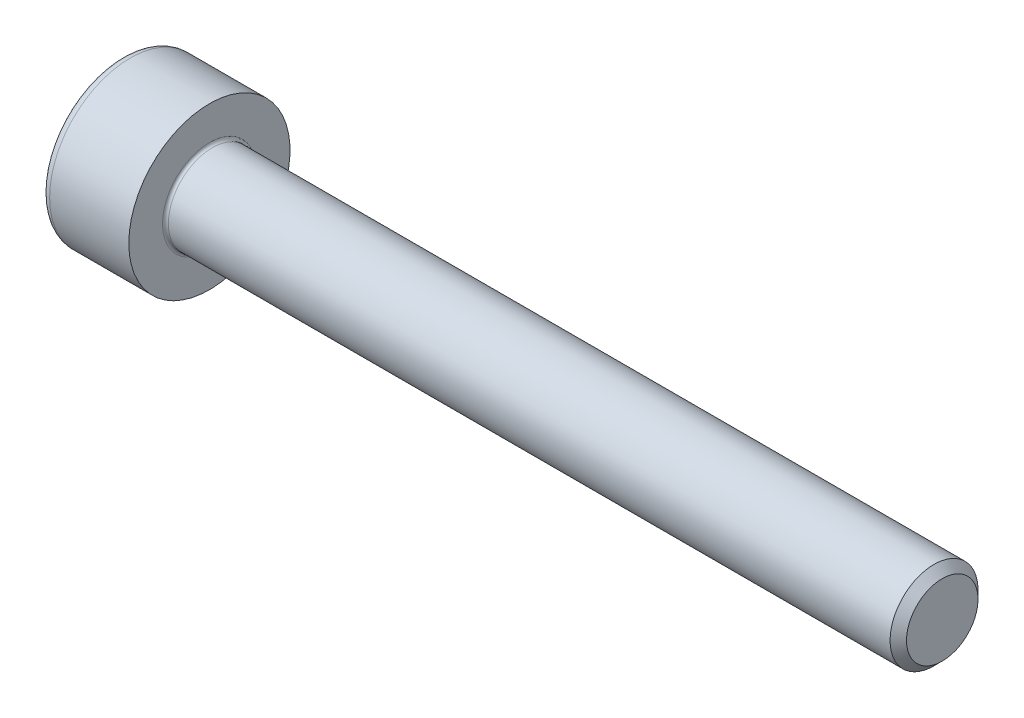
ISO-10303-21;
HEADER;
FILE_DESCRIPTION(('STEP AP214'),'2;1');
FILE_NAME('part.step','',(''),(''),'','','');
FILE_SCHEMA(('AUTOMOTIVE_DESIGN { 1 0 10303 214 1 1 1 1 }'));
ENDSEC;
DATA;
#1=APPLICATION_CONTEXT('core data for automotive mechanical design processes');
#2=APPLICATION_PROTOCOL_DEFINITION('international standard','automotive_design',2000,#1);
#3=PRODUCT_CONTEXT('',#1,'mechanical');
#4=PRODUCT('Part','Part','',(#3));
#5=PRODUCT_RELATED_PRODUCT_CATEGORY('part','',(#4));
#6=PRODUCT_DEFINITION_FORMATION('','',#4);
#7=PRODUCT_DEFINITION_CONTEXT('part definition',#1,'design');
#8=PRODUCT_DEFINITION('design','',#6,#7);
#9=PRODUCT_DEFINITION_SHAPE('','',#8);
#10=(LENGTH_UNIT() NAMED_UNIT(*) SI_UNIT(.MILLI.,.METRE.));
#11=(NAMED_UNIT(*) PLANE_ANGLE_UNIT() SI_UNIT($,.RADIAN.));
#12=(NAMED_UNIT(*) SI_UNIT($,.STERADIAN.) SOLID_ANGLE_UNIT());
#13=UNCERTAINTY_MEASURE_WITH_UNIT(LENGTH_MEASURE(1.E-05),#10,'distance_accuracy_value','');
#14=(GEOMETRIC_REPRESENTATION_CONTEXT(3) GLOBAL_UNCERTAINTY_ASSIGNED_CONTEXT((#13)) GLOBAL_UNIT_ASSIGNED_CONTEXT((#10,
#11,#12)) REPRESENTATION_CONTEXT('',''));
#15=CARTESIAN_POINT('',(0.,0.,0.));
#16=DIRECTION('',(0.,0.,1.));
#17=DIRECTION('',(1.,0.,0.));
#18=AXIS2_PLACEMENT_3D('',#15,#16,#17);
#19=CARTESIAN_POINT('',(0.,0.,0.));
#20=DIRECTION('',(-1.,0.,0.));
#21=DIRECTION('',(0.,0.,1.));
#22=AXIS2_PLACEMENT_3D('',#19,#20,#21);
#23=PLANE('',#22);
#24=DIRECTION('',(0.,-0.499999999999998,0.86602540378444));
#25=VECTOR('',#24,1.);
#26=CARTESIAN_POINT('',(0.,1.45492267835785,0.));
#27=LINE('',#26,#25);
#28=CARTESIAN_POINT('',(0.,1.45492267835785,0.));
#29=VERTEX_POINT('',#28);
#30=CARTESIAN_POINT('',(0.,0.727461339178925,1.26));
#31=VERTEX_POINT('',#30);
#32=EDGE_CURVE('E273',#29,#31,#27,.T.);
#33=ORIENTED_EDGE('',*,*,#32,.T.);
#34=DIRECTION('',(0.,1.,0.));
#35=VECTOR('',#34,1.);
#36=CARTESIAN_POINT('',(0.,-0.727461339178932,1.26));
#37=LINE('',#36,#35);
#38=CARTESIAN_POINT('',(0.,-0.727461339178932,1.26));
#39=VERTEX_POINT('',#38);
#40=EDGE_CURVE('E133',#39,#31,#37,.T.);
#41=ORIENTED_EDGE('',*,*,#40,.F.);
#42=DIRECTION('',(0.,-0.500000000000001,-0.866025403784438));
#43=VECTOR('',#42,1.);
#44=CARTESIAN_POINT('',(0.,-0.727461339178932,1.26));
#45=LINE('',#44,#43);
#46=CARTESIAN_POINT('',(0.,-1.45492267835786,0.));
#47=VERTEX_POINT('',#46);
#48=EDGE_CURVE('E276',#39,#47,#45,.T.);
#49=ORIENTED_EDGE('',*,*,#48,.T.);
#50=DIRECTION('',(0.,0.499999999999998,-0.86602540378444));
#51=VECTOR('',#50,1.);
#52=CARTESIAN_POINT('',(0.,-1.45492267835786,0.));
#53=LINE('',#52,#51);
#54=CARTESIAN_POINT('',(0.,-0.727461339178936,-1.26));
#55=VERTEX_POINT('',#54);
#56=EDGE_CURVE('E279',#47,#55,#53,.T.);
#57=ORIENTED_EDGE('',*,*,#56,.T.);
#58=DIRECTION('',(0.,-1.,0.));
#59=VECTOR('',#58,1.);
#60=CARTESIAN_POINT('',(0.,0.72746133917892,-1.26));
#61=LINE('',#60,#59);
#62=CARTESIAN_POINT('',(0.,0.72746133917892,-1.26));
#63=VERTEX_POINT('',#62);
#64=EDGE_CURVE('E282',#63,#55,#61,.T.);
#65=ORIENTED_EDGE('',*,*,#64,.F.);
#66=DIRECTION('',(0.,-0.500000000000001,-0.866025403784438));
#67=VECTOR('',#66,1.);
#68=CARTESIAN_POINT('',(0.,1.45492267835785,0.));
#69=LINE('',#68,#67);
#70=EDGE_CURVE('E128',#29,#63,#69,.T.);
#71=ORIENTED_EDGE('',*,*,#70,.F.);
#72=EDGE_LOOP('',(#33,#41,#49,#57,#65,#71));
#73=FACE_BOUND('',#72,.T.);
#74=CARTESIAN_POINT('',(0.,0.,0.));
#75=DIRECTION('',(-1.,0.,0.));
#76=DIRECTION('',(0.,0.,1.));
#77=AXIS2_PLACEMENT_3D('',#74,#75,#76);
#78=CIRCLE('',#77,2.45);
#79=CARTESIAN_POINT('',(0.,0.,2.45));
#80=VERTEX_POINT('',#79);
#81=EDGE_CURVE('E49',#80,#80,#78,.T.);
#82=ORIENTED_EDGE('',*,*,#81,.T.);
#83=EDGE_LOOP('',(#82));
#84=FACE_BOUND('',#83,.T.);
#85=ADVANCED_FACE('F41',(#73,#84),#23,.T.);
#86=CARTESIAN_POINT('',(-31.75,0.,0.));
#87=DIRECTION('',(-1.,0.,0.));
#88=DIRECTION('',(0.,0.,1.));
#89=AXIS2_PLACEMENT_3D('',#86,#87,#88);
#90=CYLINDRICAL_SURFACE('',#89,2.75);
#91=CARTESIAN_POINT('',(0.300000000000002,0.,0.));
#92=DIRECTION('',(-1.,0.,0.));
#93=DIRECTION('',(0.,0.,1.));
#94=AXIS2_PLACEMENT_3D('',#91,#92,#93);
#95=CIRCLE('',#94,2.75);
#96=CARTESIAN_POINT('',(0.300000000000002,0.,2.75));
#97=VERTEX_POINT('',#96);
#98=EDGE_CURVE('E11',#97,#97,#95,.F.);
#99=ORIENTED_EDGE('',*,*,#98,.T.);
#100=EDGE_LOOP('',(#99));
#101=FACE_BOUND('',#100,.T.);
#102=CARTESIAN_POINT('',(3.,0.,0.));
#103=DIRECTION('',(-1.,0.,0.));
#104=DIRECTION('',(0.,0.,1.));
#105=AXIS2_PLACEMENT_3D('',#102,#103,#104);
#106=CIRCLE('',#105,2.75);
#107=CARTESIAN_POINT('',(3.,0.,2.75));
#108=VERTEX_POINT('',#107);
#109=EDGE_CURVE('E151',#108,#108,#106,.T.);
#110=ORIENTED_EDGE('',*,*,#109,.T.);
#111=EDGE_LOOP('',(#110));
#112=FACE_BOUND('',#111,.T.);
#113=ADVANCED_FACE('F176',(#101,#112),#90,.T.);
#114=CARTESIAN_POINT('',(3.,2.75,0.));
#115=DIRECTION('',(1.,0.,0.));
#116=DIRECTION('',(0.,0.,-1.));
#117=AXIS2_PLACEMENT_3D('',#114,#115,#116);
#118=PLANE('',#117);
#119=CARTESIAN_POINT('',(3.,0.,0.));
#120=DIRECTION('',(1.,0.,0.));
#121=DIRECTION('',(0.,0.,-1.));
#122=AXIS2_PLACEMENT_3D('',#119,#120,#121);
#123=CIRCLE('',#122,1.59999999999999);
#124=CARTESIAN_POINT('',(3.,0.,-1.59999999999999));
#125=VERTEX_POINT('',#124);
#126=EDGE_CURVE('E155',#125,#125,#123,.F.);
#127=ORIENTED_EDGE('',*,*,#126,.T.);
#128=EDGE_LOOP('',(#127));
#129=FACE_BOUND('',#128,.T.);
#130=ORIENTED_EDGE('',*,*,#109,.F.);
#131=EDGE_LOOP('',(#130));
#132=FACE_BOUND('',#131,.T.);
#133=ADVANCED_FACE('F182',(#129,#132),#118,.T.);
#134=CARTESIAN_POINT('',(-31.75,0.,0.));
#135=DIRECTION('',(-1.,0.,0.));
#136=DIRECTION('',(0.,0.,1.));
#137=AXIS2_PLACEMENT_3D('',#134,#135,#136);
#138=CYLINDRICAL_SURFACE('',#137,1.49999999999999);
#139=CARTESIAN_POINT('',(3.1,0.,0.));
#140=DIRECTION('',(1.,0.,0.));
#141=DIRECTION('',(0.,0.,-1.));
#142=AXIS2_PLACEMENT_3D('',#139,#140,#141);
#143=CIRCLE('',#142,1.49999999999999);
#144=CARTESIAN_POINT('',(3.1,0.,-1.49999999999999));
#145=VERTEX_POINT('',#144);
#146=EDGE_CURVE('E158',#145,#145,#143,.T.);
#147=ORIENTED_EDGE('',*,*,#146,.T.);
#148=EDGE_LOOP('',(#147));
#149=FACE_BOUND('',#148,.T.);
#150=CARTESIAN_POINT('',(27.7195,0.,0.));
#151=DIRECTION('',(-1.,0.,0.));
#152=DIRECTION('',(0.,0.,1.));
#153=AXIS2_PLACEMENT_3D('',#150,#151,#152);
#154=CIRCLE('',#153,1.49999999999998);
#155=CARTESIAN_POINT('',(27.7195,0.,1.49999999999998));
#156=VERTEX_POINT('',#155);
#157=EDGE_CURVE('E148',#156,#156,#154,.T.);
#158=ORIENTED_EDGE('',*,*,#157,.T.);
#159=EDGE_LOOP('',(#158));
#160=FACE_BOUND('',#159,.T.);
#161=ADVANCED_FACE('F188',(#149,#160),#138,.T.);
#162=CARTESIAN_POINT('',(28.,0.,0.));
#163=DIRECTION('',(-1.,0.,0.));
#164=DIRECTION('',(0.,0.,1.));
#165=AXIS2_PLACEMENT_3D('',#162,#163,#164);
#166=CONICAL_SURFACE('',#165,1.2195,0.785398163397376);
#167=ORIENTED_EDGE('',*,*,#157,.F.);
#168=EDGE_LOOP('',(#167));
#169=FACE_BOUND('',#168,.T.);
#170=CARTESIAN_POINT('',(28.,0.,0.));
#171=DIRECTION('',(-1.,0.,0.));
#172=DIRECTION('',(0.,0.,1.));
#173=AXIS2_PLACEMENT_3D('',#170,#171,#172);
#174=CIRCLE('',#173,1.2195);
#175=CARTESIAN_POINT('',(28.,0.,1.2195));
#176=VERTEX_POINT('',#175);
#177=EDGE_CURVE('E144',#176,#176,#174,.T.);
#178=ORIENTED_EDGE('',*,*,#177,.T.);
#179=EDGE_LOOP('',(#178));
#180=FACE_BOUND('',#179,.T.);
#181=ADVANCED_FACE('F192',(#169,#180),#166,.T.);
#182=CARTESIAN_POINT('',(28.,1.2195,0.));
#183=DIRECTION('',(1.,0.,0.));
#184=DIRECTION('',(0.,0.,-1.));
#185=AXIS2_PLACEMENT_3D('',#182,#183,#184);
#186=PLANE('',#185);
#187=ORIENTED_EDGE('',*,*,#177,.F.);
#188=EDGE_LOOP('',(#187));
#189=FACE_BOUND('',#188,.T.);
#190=ADVANCED_FACE('F172',(#189),#186,.T.);
#191=CARTESIAN_POINT('',(3.1,0.,0.));
#192=DIRECTION('',(1.,0.,0.));
#193=DIRECTION('',(0.,0.,-1.));
#194=AXIS2_PLACEMENT_3D('',#191,#192,#193);
#195=TOROIDAL_SURFACE('',#194,1.59999999999999,0.1);
#196=ORIENTED_EDGE('',*,*,#146,.F.);
#197=EDGE_LOOP('',(#196));
#198=FACE_BOUND('',#197,.T.);
#199=ORIENTED_EDGE('',*,*,#126,.F.);
#200=EDGE_LOOP('',(#199));
#201=FACE_BOUND('',#200,.T.);
#202=ADVANCED_FACE('F165',(#198,#201),#195,.F.);
#203=CARTESIAN_POINT('',(0.300000000000002,0.,0.));
#204=DIRECTION('',(-1.,0.,0.));
#205=DIRECTION('',(0.,0.,1.));
#206=AXIS2_PLACEMENT_3D('',#203,#204,#205);
#207=TOROIDAL_SURFACE('',#206,2.45,0.3);
#208=ORIENTED_EDGE('',*,*,#98,.F.);
#209=EDGE_LOOP('',(#208));
#210=FACE_BOUND('',#209,.T.);
#211=ORIENTED_EDGE('',*,*,#81,.F.);
#212=EDGE_LOOP('',(#211));
#213=FACE_BOUND('',#212,.T.);
#214=ADVANCED_FACE('F43',(#210,#213),#207,.T.);
#215=CARTESIAN_POINT('',(1.3,1.45492267835785,0.));
#216=DIRECTION('',(0.,-0.86602540378444,-0.499999999999998));
#217=DIRECTION('',(0.,0.499999999999998,-0.86602540378444));
#218=AXIS2_PLACEMENT_3D('',#215,#216,#217);
#219=PLANE('',#218);
#220=ORIENTED_EDGE('',*,*,#32,.F.);
#221=DIRECTION('',(-1.,0.,0.));
#222=VECTOR('',#221,1.);
#223=CARTESIAN_POINT('',(1.3,1.45492267835785,0.));
#224=LINE('',#223,#222);
#225=CARTESIAN_POINT('',(1.3,1.45492267835785,0.));
#226=VERTEX_POINT('',#225);
#227=EDGE_CURVE('E272',#226,#29,#224,.T.);
#228=ORIENTED_EDGE('',*,*,#227,.F.);
#229=DIRECTION('',(0.,-0.499999999999998,0.86602540378444));
#230=VECTOR('',#229,1.);
#231=CARTESIAN_POINT('',(1.3,1.45492267835785,0.));
#232=LINE('',#231,#230);
#233=CARTESIAN_POINT('',(1.3,1.09119200876839,0.629999999999998));
#234=VERTEX_POINT('',#233);
#235=EDGE_CURVE('E56',#226,#234,#232,.T.);
#236=ORIENTED_EDGE('',*,*,#235,.T.);
#237=CARTESIAN_POINT('',(1.3,0.727461339178925,1.26));
#238=VERTEX_POINT('',#237);
#239=EDGE_CURVE('E114',#234,#238,#232,.T.);
#240=ORIENTED_EDGE('',*,*,#239,.T.);
#241=DIRECTION('',(-1.,0.,0.));
#242=VECTOR('',#241,1.);
#243=CARTESIAN_POINT('',(1.3,0.727461339178925,1.26));
#244=LINE('',#243,#242);
#245=EDGE_CURVE('E126',#238,#31,#244,.T.);
#246=ORIENTED_EDGE('',*,*,#245,.T.);
#247=EDGE_LOOP('',(#220,#228,#236,#240,#246));
#248=FACE_BOUND('',#247,.T.);
#249=ADVANCED_FACE('F125',(#248),#219,.T.);
#250=CARTESIAN_POINT('',(1.3,-0.727461339178932,1.26));
#251=DIRECTION('',(0.,0.,1.));
#252=DIRECTION('',(0.,-1.,0.));
#253=AXIS2_PLACEMENT_3D('',#250,#251,#252);
#254=PLANE('',#253);
#255=ORIENTED_EDGE('',*,*,#40,.T.);
#256=ORIENTED_EDGE('',*,*,#245,.F.);
#257=DIRECTION('',(0.,1.,0.));
#258=VECTOR('',#257,1.);
#259=CARTESIAN_POINT('',(1.3,-0.727461339178932,1.26));
#260=LINE('',#259,#258);
#261=CARTESIAN_POINT('',(1.3,0.,1.26));
#262=VERTEX_POINT('',#261);
#263=EDGE_CURVE('E112',#262,#238,#260,.T.);
#264=ORIENTED_EDGE('',*,*,#263,.F.);
#265=CARTESIAN_POINT('',(1.3,-0.727461339178932,1.26));
#266=VERTEX_POINT('',#265);
#267=EDGE_CURVE('E122',#266,#262,#260,.T.);
#268=ORIENTED_EDGE('',*,*,#267,.F.);
#269=DIRECTION('',(-1.,0.,0.));
#270=VECTOR('',#269,1.);
#271=CARTESIAN_POINT('',(1.3,-0.727461339178932,1.26));
#272=LINE('',#271,#270);
#273=EDGE_CURVE('E135',#266,#39,#272,.T.);
#274=ORIENTED_EDGE('',*,*,#273,.T.);
#275=EDGE_LOOP('',(#255,#256,#264,#268,#274));
#276=FACE_BOUND('',#275,.T.);
#277=ADVANCED_FACE('F130',(#276),#254,.F.);
#278=CARTESIAN_POINT('',(1.3,-0.727461339178932,1.26));
#279=DIRECTION('',(0.,0.866025403784438,-0.500000000000001));
#280=DIRECTION('',(0.,0.500000000000001,0.866025403784438));
#281=AXIS2_PLACEMENT_3D('',#278,#279,#280);
#282=PLANE('',#281);
#283=ORIENTED_EDGE('',*,*,#48,.F.);
#284=ORIENTED_EDGE('',*,*,#273,.F.);
#285=DIRECTION('',(0.,-0.500000000000001,-0.866025403784438));
#286=VECTOR('',#285,1.);
#287=CARTESIAN_POINT('',(1.3,-0.727461339178932,1.26));
#288=LINE('',#287,#286);
#289=CARTESIAN_POINT('',(1.3,-1.0911920087684,0.630000000000003));
#290=VERTEX_POINT('',#289);
#291=EDGE_CURVE('E253',#266,#290,#288,.T.);
#292=ORIENTED_EDGE('',*,*,#291,.T.);
#293=CARTESIAN_POINT('',(1.3,-1.45492267835786,0.));
#294=VERTEX_POINT('',#293);
#295=EDGE_CURVE('E255',#290,#294,#288,.T.);
#296=ORIENTED_EDGE('',*,*,#295,.T.);
#297=DIRECTION('',(-1.,0.,0.));
#298=VECTOR('',#297,1.);
#299=CARTESIAN_POINT('',(1.3,-1.45492267835786,0.));
#300=LINE('',#299,#298);
#301=EDGE_CURVE('E140',#294,#47,#300,.T.);
#302=ORIENTED_EDGE('',*,*,#301,.T.);
#303=EDGE_LOOP('',(#283,#284,#292,#296,#302));
#304=FACE_BOUND('',#303,.T.);
#305=ADVANCED_FACE('F205',(#304),#282,.T.);
#306=CARTESIAN_POINT('',(1.3,-1.45492267835786,0.));
#307=DIRECTION('',(0.,0.86602540378444,0.499999999999998));
#308=DIRECTION('',(0.,-0.499999999999998,0.86602540378444));
#309=AXIS2_PLACEMENT_3D('',#306,#307,#308);
#310=PLANE('',#309);
#311=ORIENTED_EDGE('',*,*,#56,.F.);
#312=ORIENTED_EDGE('',*,*,#301,.F.);
#313=DIRECTION('',(0.,0.499999999999998,-0.86602540378444));
#314=VECTOR('',#313,1.);
#315=CARTESIAN_POINT('',(1.3,-1.45492267835786,0.));
#316=LINE('',#315,#314);
#317=CARTESIAN_POINT('',(1.3,-1.0911920087684,-0.63));
#318=VERTEX_POINT('',#317);
#319=EDGE_CURVE('E258',#294,#318,#316,.T.);
#320=ORIENTED_EDGE('',*,*,#319,.T.);
#321=CARTESIAN_POINT('',(1.3,-0.727461339178936,-1.26));
#322=VERTEX_POINT('',#321);
#323=EDGE_CURVE('E262',#318,#322,#316,.T.);
#324=ORIENTED_EDGE('',*,*,#323,.T.);
#325=DIRECTION('',(-1.,0.,0.));
#326=VECTOR('',#325,1.);
#327=CARTESIAN_POINT('',(1.3,-0.727461339178936,-1.26));
#328=LINE('',#327,#326);
#329=EDGE_CURVE('E291',#322,#55,#328,.T.);
#330=ORIENTED_EDGE('',*,*,#329,.T.);
#331=EDGE_LOOP('',(#311,#312,#320,#324,#330));
#332=FACE_BOUND('',#331,.T.);
#333=ADVANCED_FACE('F208',(#332),#310,.T.);
#334=CARTESIAN_POINT('',(1.3,0.72746133917892,-1.26));
#335=DIRECTION('',(0.,0.,-1.));
#336=DIRECTION('',(0.,1.,0.));
#337=AXIS2_PLACEMENT_3D('',#334,#335,#336);
#338=PLANE('',#337);
#339=ORIENTED_EDGE('',*,*,#64,.T.);
#340=ORIENTED_EDGE('',*,*,#329,.F.);
#341=DIRECTION('',(0.,-1.,0.));
#342=VECTOR('',#341,1.);
#343=CARTESIAN_POINT('',(1.3,0.72746133917892,-1.26));
#344=LINE('',#343,#342);
#345=CARTESIAN_POINT('',(1.3,0.,-1.26));
#346=VERTEX_POINT('',#345);
#347=EDGE_CURVE('E266',#346,#322,#344,.T.);
#348=ORIENTED_EDGE('',*,*,#347,.F.);
#349=CARTESIAN_POINT('',(1.3,0.72746133917892,-1.26));
#350=VERTEX_POINT('',#349);
#351=EDGE_CURVE('E267',#350,#346,#344,.T.);
#352=ORIENTED_EDGE('',*,*,#351,.F.);
#353=DIRECTION('',(-1.,0.,0.));
#354=VECTOR('',#353,1.);
#355=CARTESIAN_POINT('',(1.3,0.72746133917892,-1.26));
#356=LINE('',#355,#354);
#357=EDGE_CURVE('E288',#350,#63,#356,.T.);
#358=ORIENTED_EDGE('',*,*,#357,.T.);
#359=EDGE_LOOP('',(#339,#340,#348,#352,#358));
#360=FACE_BOUND('',#359,.T.);
#361=ADVANCED_FACE('F212',(#360),#338,.F.);
#362=CARTESIAN_POINT('',(1.3,1.45492267835785,0.));
#363=DIRECTION('',(0.,0.866025403784438,-0.500000000000001));
#364=DIRECTION('',(0.,0.500000000000001,0.866025403784438));
#365=AXIS2_PLACEMENT_3D('',#362,#363,#364);
#366=PLANE('',#365);
#367=ORIENTED_EDGE('',*,*,#70,.T.);
#368=ORIENTED_EDGE('',*,*,#357,.F.);
#369=DIRECTION('',(0.,-0.500000000000001,-0.866025403784438));
#370=VECTOR('',#369,1.);
#371=CARTESIAN_POINT('',(1.3,1.45492267835785,0.));
#372=LINE('',#371,#370);
#373=CARTESIAN_POINT('',(1.3,1.09119200876839,-0.629999999999999));
#374=VERTEX_POINT('',#373);
#375=EDGE_CURVE('E270',#374,#350,#372,.T.);
#376=ORIENTED_EDGE('',*,*,#375,.F.);
#377=EDGE_CURVE('E244',#226,#374,#372,.T.);
#378=ORIENTED_EDGE('',*,*,#377,.F.);
#379=ORIENTED_EDGE('',*,*,#227,.T.);
#380=EDGE_LOOP('',(#367,#368,#376,#378,#379));
#381=FACE_BOUND('',#380,.T.);
#382=ADVANCED_FACE('F216',(#381),#366,.F.);
#383=CARTESIAN_POINT('',(1.3,0.727461339178924,1.26));
#384=DIRECTION('',(-1.,0.,0.));
#385=DIRECTION('',(0.,0.,1.));
#386=AXIS2_PLACEMENT_3D('',#383,#384,#385);
#387=PLANE('',#386);
#388=CARTESIAN_POINT('',(1.3,0.,0.));
#389=DIRECTION('',(-1.,0.,0.));
#390=DIRECTION('',(0.,0.,1.));
#391=AXIS2_PLACEMENT_3D('',#388,#389,#390);
#392=CIRCLE('',#391,1.26);
#393=EDGE_CURVE('E134',#290,#262,#392,.T.);
#394=ORIENTED_EDGE('',*,*,#393,.F.);
#395=ORIENTED_EDGE('',*,*,#291,.F.);
#396=ORIENTED_EDGE('',*,*,#267,.T.);
#397=EDGE_LOOP('',(#394,#395,#396));
#398=FACE_BOUND('',#397,.T.);
#399=ADVANCED_FACE('F220',(#398),#387,.T.);
#400=EDGE_CURVE('E138',#318,#290,#392,.T.);
#401=ORIENTED_EDGE('',*,*,#400,.F.);
#402=ORIENTED_EDGE('',*,*,#319,.F.);
#403=ORIENTED_EDGE('',*,*,#295,.F.);
#404=EDGE_LOOP('',(#401,#402,#403));
#405=FACE_BOUND('',#404,.T.);
#406=ADVANCED_FACE('F223',(#405),#387,.T.);
#407=EDGE_CURVE('E297',#346,#318,#392,.T.);
#408=ORIENTED_EDGE('',*,*,#407,.F.);
#409=ORIENTED_EDGE('',*,*,#347,.T.);
#410=ORIENTED_EDGE('',*,*,#323,.F.);
#411=EDGE_LOOP('',(#408,#409,#410));
#412=FACE_BOUND('',#411,.T.);
#413=ADVANCED_FACE('F228',(#412),#387,.T.);
#414=EDGE_CURVE('E247',#374,#346,#392,.T.);
#415=ORIENTED_EDGE('',*,*,#414,.F.);
#416=ORIENTED_EDGE('',*,*,#375,.T.);
#417=ORIENTED_EDGE('',*,*,#351,.T.);
#418=EDGE_LOOP('',(#415,#416,#417));
#419=FACE_BOUND('',#418,.T.);
#420=ADVANCED_FACE('F235',(#419),#387,.T.);
#421=EDGE_CURVE('E145',#234,#374,#392,.T.);
#422=ORIENTED_EDGE('',*,*,#421,.F.);
#423=ORIENTED_EDGE('',*,*,#235,.F.);
#424=ORIENTED_EDGE('',*,*,#377,.T.);
#425=EDGE_LOOP('',(#422,#423,#424));
#426=FACE_BOUND('',#425,.T.);
#427=ADVANCED_FACE('F231',(#426),#387,.T.);
#428=EDGE_CURVE('E117',#262,#234,#392,.T.);
#429=ORIENTED_EDGE('',*,*,#428,.F.);
#430=ORIENTED_EDGE('',*,*,#263,.T.);
#431=ORIENTED_EDGE('',*,*,#239,.F.);
#432=EDGE_LOOP('',(#429,#430,#431));
#433=FACE_BOUND('',#432,.T.);
#434=ADVANCED_FACE('F113',(#433),#387,.T.);
#435=CARTESIAN_POINT('',(1.3,0.,0.));
#436=DIRECTION('',(-1.,0.,0.));
#437=DIRECTION('',(0.,0.,1.));
#438=AXIS2_PLACEMENT_3D('',#435,#436,#437);
#439=CONICAL_SURFACE('',#438,1.26,1.04719755119659);
#440=CARTESIAN_POINT('',(2.02746133917894,0.,0.));
#441=VERTEX_POINT('',#440);
#442=VERTEX_LOOP('',#441);
#443=FACE_BOUND('',#442,.T.);
#444=ORIENTED_EDGE('',*,*,#428,.T.);
#445=ORIENTED_EDGE('',*,*,#421,.T.);
#446=ORIENTED_EDGE('',*,*,#414,.T.);
#447=ORIENTED_EDGE('',*,*,#407,.T.);
#448=ORIENTED_EDGE('',*,*,#400,.T.);
#449=ORIENTED_EDGE('',*,*,#393,.T.);
#450=EDGE_LOOP('',(#444,#445,#446,#447,#448,#449));
#451=FACE_BOUND('',#450,.T.);
#452=ADVANCED_FACE('F200',(#443,#451),#439,.F.);
#453=CLOSED_SHELL('',(#85,#113,#133,#161,#181,#190,#202,#214,#249,#277,#305,#333,#361,#382,#399,
#406,#413,#420,#427,#434,#452));
#454=MANIFOLD_SOLID_BREP('B2',#453);
#455=ADVANCED_BREP_SHAPE_REPRESENTATION('',(#18,#454),#14);
#456=SHAPE_DEFINITION_REPRESENTATION(#9,#455);
ENDSEC;
END-ISO-10303-21;
